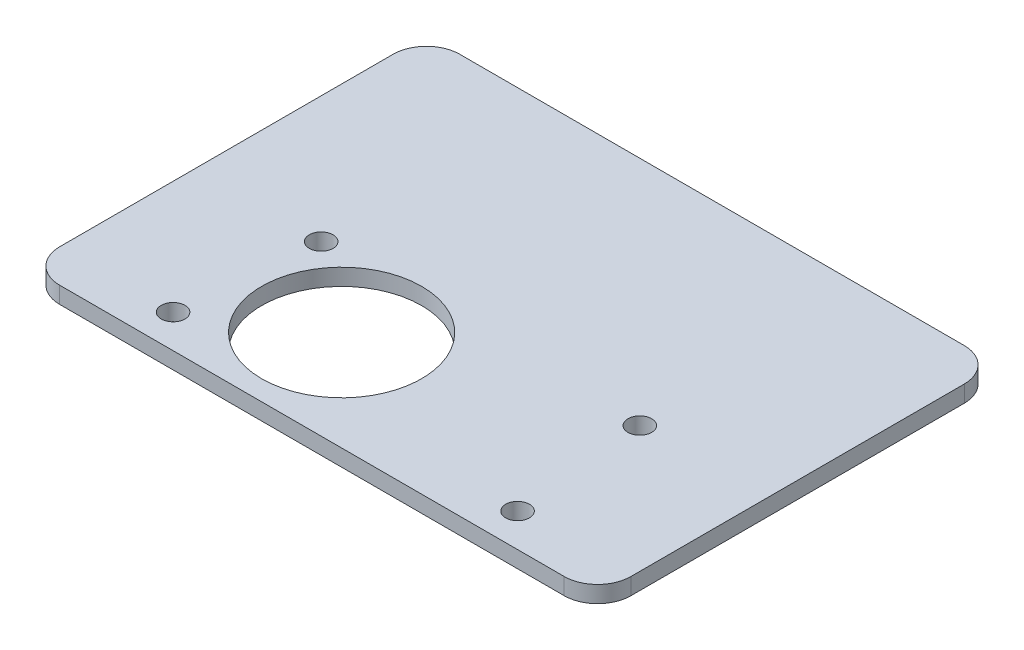
ISO-10303-21;
HEADER;
FILE_DESCRIPTION(('STEP AP214'),'2;1');
FILE_NAME('part.step','',(''),(''),'','','');
FILE_SCHEMA(('AUTOMOTIVE_DESIGN { 1 0 10303 214 1 1 1 1 }'));
ENDSEC;
DATA;
#1=APPLICATION_CONTEXT('core data for automotive mechanical design processes');
#2=APPLICATION_PROTOCOL_DEFINITION('international standard','automotive_design',2000,#1);
#3=PRODUCT_CONTEXT('',#1,'mechanical');
#4=PRODUCT('Part','Part','',(#3));
#5=PRODUCT_RELATED_PRODUCT_CATEGORY('part','',(#4));
#6=PRODUCT_DEFINITION_FORMATION('','',#4);
#7=PRODUCT_DEFINITION_CONTEXT('part definition',#1,'design');
#8=PRODUCT_DEFINITION('design','',#6,#7);
#9=PRODUCT_DEFINITION_SHAPE('','',#8);
#10=(LENGTH_UNIT() NAMED_UNIT(*) SI_UNIT(.MILLI.,.METRE.));
#11=(NAMED_UNIT(*) PLANE_ANGLE_UNIT() SI_UNIT($,.RADIAN.));
#12=(NAMED_UNIT(*) SI_UNIT($,.STERADIAN.) SOLID_ANGLE_UNIT());
#13=UNCERTAINTY_MEASURE_WITH_UNIT(LENGTH_MEASURE(1.E-05),#10,'distance_accuracy_value','');
#14=(GEOMETRIC_REPRESENTATION_CONTEXT(3) GLOBAL_UNCERTAINTY_ASSIGNED_CONTEXT((#13)) GLOBAL_UNIT_ASSIGNED_CONTEXT((#10,
#11,#12)) REPRESENTATION_CONTEXT('',''));
#15=CARTESIAN_POINT('',(0.,0.,0.));
#16=DIRECTION('',(0.,0.,1.));
#17=DIRECTION('',(1.,0.,0.));
#18=AXIS2_PLACEMENT_3D('',#15,#16,#17);
#19=CARTESIAN_POINT('',(30.725,-3.175,-25.4));
#20=DIRECTION('',(0.,-1.,0.));
#21=DIRECTION('',(0.,0.,-1.));
#22=AXIS2_PLACEMENT_3D('',#19,#20,#21);
#23=CYLINDRICAL_SURFACE('',#22,3.175);
#24=CARTESIAN_POINT('',(30.725,-4.7625,-25.4));
#25=DIRECTION('',(0.,-1.,0.));
#26=DIRECTION('',(0.,0.,-1.));
#27=AXIS2_PLACEMENT_3D('',#24,#25,#26);
#28=CIRCLE('',#27,3.175);
#29=CARTESIAN_POINT('',(30.725,-4.7625,-28.575));
#30=VERTEX_POINT('',#29);
#31=CARTESIAN_POINT('',(33.9,-4.7625,-25.4));
#32=VERTEX_POINT('',#31);
#33=EDGE_CURVE('E134',#30,#32,#28,.T.);
#34=ORIENTED_EDGE('',*,*,#33,.F.);
#35=DIRECTION('',(0.,-1.,0.));
#36=VECTOR('',#35,1.);
#37=CARTESIAN_POINT('',(30.725,-3.175,-28.575));
#38=LINE('',#37,#36);
#39=CARTESIAN_POINT('',(30.725,-3.175,-28.575));
#40=VERTEX_POINT('',#39);
#41=EDGE_CURVE('E11',#40,#30,#38,.T.);
#42=ORIENTED_EDGE('',*,*,#41,.F.);
#43=CARTESIAN_POINT('',(30.725,-3.175,-25.4));
#44=DIRECTION('',(0.,-1.,0.));
#45=DIRECTION('',(0.,0.,-1.));
#46=AXIS2_PLACEMENT_3D('',#43,#44,#45);
#47=CIRCLE('',#46,3.175);
#48=CARTESIAN_POINT('',(33.9,-3.175,-25.4));
#49=VERTEX_POINT('',#48);
#50=EDGE_CURVE('E155',#40,#49,#47,.T.);
#51=ORIENTED_EDGE('',*,*,#50,.T.);
#52=DIRECTION('',(0.,-1.,0.));
#53=VECTOR('',#52,1.);
#54=CARTESIAN_POINT('',(33.9,-3.175,-25.4));
#55=LINE('',#54,#53);
#56=EDGE_CURVE('E40',#49,#32,#55,.T.);
#57=ORIENTED_EDGE('',*,*,#56,.T.);
#58=EDGE_LOOP('',(#34,#42,#51,#57));
#59=FACE_BOUND('',#58,.T.);
#60=ADVANCED_FACE('F37',(#59),#23,.T.);
#61=CARTESIAN_POINT('',(-17.325,-3.175,-28.575));
#62=DIRECTION('',(0.,0.,-1.));
#63=DIRECTION('',(-1.,0.,0.));
#64=AXIS2_PLACEMENT_3D('',#61,#62,#63);
#65=PLANE('',#64);
#66=DIRECTION('',(1.,0.,0.));
#67=VECTOR('',#66,1.);
#68=CARTESIAN_POINT('',(-17.325,-4.7625,-28.575));
#69=LINE('',#68,#67);
#70=CARTESIAN_POINT('',(-17.325,-4.7625,-28.575));
#71=VERTEX_POINT('',#70);
#72=EDGE_CURVE('E153',#71,#30,#69,.T.);
#73=ORIENTED_EDGE('',*,*,#72,.F.);
#74=DIRECTION('',(0.,-1.,0.));
#75=VECTOR('',#74,1.);
#76=CARTESIAN_POINT('',(-17.325,-3.175,-28.575));
#77=LINE('',#76,#75);
#78=CARTESIAN_POINT('',(-17.325,-3.175,-28.575));
#79=VERTEX_POINT('',#78);
#80=EDGE_CURVE('E46',#79,#71,#77,.T.);
#81=ORIENTED_EDGE('',*,*,#80,.F.);
#82=DIRECTION('',(1.,0.,0.));
#83=VECTOR('',#82,1.);
#84=CARTESIAN_POINT('',(-17.325,-3.175,-28.575));
#85=LINE('',#84,#83);
#86=EDGE_CURVE('E124',#79,#40,#85,.T.);
#87=ORIENTED_EDGE('',*,*,#86,.T.);
#88=ORIENTED_EDGE('',*,*,#41,.T.);
#89=EDGE_LOOP('',(#73,#81,#87,#88));
#90=FACE_BOUND('',#89,.T.);
#91=ADVANCED_FACE('F167',(#90),#65,.T.);
#92=CARTESIAN_POINT('',(-17.325,-3.175,-25.4));
#93=DIRECTION('',(0.,-1.,0.));
#94=DIRECTION('',(0.,0.,-1.));
#95=AXIS2_PLACEMENT_3D('',#92,#93,#94);
#96=CYLINDRICAL_SURFACE('',#95,3.175);
#97=CARTESIAN_POINT('',(-17.325,-4.7625,-25.4));
#98=DIRECTION('',(0.,-1.,0.));
#99=DIRECTION('',(0.,0.,-1.));
#100=AXIS2_PLACEMENT_3D('',#97,#98,#99);
#101=CIRCLE('',#100,3.175);
#102=CARTESIAN_POINT('',(-20.5,-4.7625,-25.4));
#103=VERTEX_POINT('',#102);
#104=EDGE_CURVE('E111',#103,#71,#101,.T.);
#105=ORIENTED_EDGE('',*,*,#104,.F.);
#106=DIRECTION('',(0.,-1.,0.));
#107=VECTOR('',#106,1.);
#108=CARTESIAN_POINT('',(-20.5,-3.175,-25.4));
#109=LINE('',#108,#107);
#110=CARTESIAN_POINT('',(-20.5,-3.175,-25.4));
#111=VERTEX_POINT('',#110);
#112=EDGE_CURVE('E106',#111,#103,#109,.T.);
#113=ORIENTED_EDGE('',*,*,#112,.F.);
#114=CARTESIAN_POINT('',(-17.325,-3.175,-25.4));
#115=DIRECTION('',(0.,-1.,0.));
#116=DIRECTION('',(0.,0.,-1.));
#117=AXIS2_PLACEMENT_3D('',#114,#115,#116);
#118=CIRCLE('',#117,3.175);
#119=EDGE_CURVE('E109',#111,#79,#118,.T.);
#120=ORIENTED_EDGE('',*,*,#119,.T.);
#121=ORIENTED_EDGE('',*,*,#80,.T.);
#122=EDGE_LOOP('',(#105,#113,#120,#121));
#123=FACE_BOUND('',#122,.T.);
#124=ADVANCED_FACE('F108',(#123),#96,.T.);
#125=CARTESIAN_POINT('',(-20.5,-3.175,6.35));
#126=DIRECTION('',(-1.,0.,0.));
#127=DIRECTION('',(0.,0.,1.));
#128=AXIS2_PLACEMENT_3D('',#125,#126,#127);
#129=PLANE('',#128);
#130=DIRECTION('',(0.,0.,-1.));
#131=VECTOR('',#130,1.);
#132=CARTESIAN_POINT('',(-20.5,-4.7625,6.35));
#133=LINE('',#132,#131);
#134=CARTESIAN_POINT('',(-20.5,-4.7625,6.35));
#135=VERTEX_POINT('',#134);
#136=EDGE_CURVE('E150',#135,#103,#133,.T.);
#137=ORIENTED_EDGE('',*,*,#136,.F.);
#138=DIRECTION('',(0.,-1.,0.));
#139=VECTOR('',#138,1.);
#140=CARTESIAN_POINT('',(-20.5,-3.175,6.35));
#141=LINE('',#140,#139);
#142=CARTESIAN_POINT('',(-20.5,-3.175,6.35));
#143=VERTEX_POINT('',#142);
#144=EDGE_CURVE('E116',#143,#135,#141,.T.);
#145=ORIENTED_EDGE('',*,*,#144,.F.);
#146=DIRECTION('',(0.,0.,-1.));
#147=VECTOR('',#146,1.);
#148=CARTESIAN_POINT('',(-20.5,-3.175,6.35));
#149=LINE('',#148,#147);
#150=EDGE_CURVE('E122',#143,#111,#149,.T.);
#151=ORIENTED_EDGE('',*,*,#150,.T.);
#152=ORIENTED_EDGE('',*,*,#112,.T.);
#153=EDGE_LOOP('',(#137,#145,#151,#152));
#154=FACE_BOUND('',#153,.T.);
#155=ADVANCED_FACE('F126',(#154),#129,.T.);
#156=CARTESIAN_POINT('',(-17.325,-3.175,6.35));
#157=DIRECTION('',(0.,-1.,0.));
#158=DIRECTION('',(0.,0.,-1.));
#159=AXIS2_PLACEMENT_3D('',#156,#157,#158);
#160=CYLINDRICAL_SURFACE('',#159,3.175);
#161=CARTESIAN_POINT('',(-17.325,-4.7625,6.35));
#162=DIRECTION('',(0.,-1.,0.));
#163=DIRECTION('',(0.,0.,-1.));
#164=AXIS2_PLACEMENT_3D('',#161,#162,#163);
#165=CIRCLE('',#164,3.175);
#166=CARTESIAN_POINT('',(-17.325,-4.7625,9.525));
#167=VERTEX_POINT('',#166);
#168=EDGE_CURVE('E147',#167,#135,#165,.T.);
#169=ORIENTED_EDGE('',*,*,#168,.F.);
#170=DIRECTION('',(0.,-1.,0.));
#171=VECTOR('',#170,1.);
#172=CARTESIAN_POINT('',(-17.325,-3.175,9.525));
#173=LINE('',#172,#171);
#174=CARTESIAN_POINT('',(-17.325,-3.175,9.525));
#175=VERTEX_POINT('',#174);
#176=EDGE_CURVE('E159',#175,#167,#173,.T.);
#177=ORIENTED_EDGE('',*,*,#176,.F.);
#178=CARTESIAN_POINT('',(-17.325,-3.175,6.35));
#179=DIRECTION('',(0.,-1.,0.));
#180=DIRECTION('',(0.,0.,-1.));
#181=AXIS2_PLACEMENT_3D('',#178,#179,#180);
#182=CIRCLE('',#181,3.175);
#183=EDGE_CURVE('E127',#175,#143,#182,.T.);
#184=ORIENTED_EDGE('',*,*,#183,.T.);
#185=ORIENTED_EDGE('',*,*,#144,.T.);
#186=EDGE_LOOP('',(#169,#177,#184,#185));
#187=FACE_BOUND('',#186,.T.);
#188=ADVANCED_FACE('F180',(#187),#160,.T.);
#189=CARTESIAN_POINT('',(30.725,-3.175,9.525));
#190=DIRECTION('',(0.,0.,1.));
#191=DIRECTION('',(1.,0.,0.));
#192=AXIS2_PLACEMENT_3D('',#189,#190,#191);
#193=PLANE('',#192);
#194=DIRECTION('',(-1.,0.,0.));
#195=VECTOR('',#194,1.);
#196=CARTESIAN_POINT('',(30.725,-4.7625,9.525));
#197=LINE('',#196,#195);
#198=CARTESIAN_POINT('',(30.725,-4.7625,9.525));
#199=VERTEX_POINT('',#198);
#200=EDGE_CURVE('E144',#199,#167,#197,.T.);
#201=ORIENTED_EDGE('',*,*,#200,.F.);
#202=DIRECTION('',(0.,-1.,0.));
#203=VECTOR('',#202,1.);
#204=CARTESIAN_POINT('',(30.725,-3.175,9.525));
#205=LINE('',#204,#203);
#206=CARTESIAN_POINT('',(30.725,-3.175,9.525));
#207=VERTEX_POINT('',#206);
#208=EDGE_CURVE('E161',#207,#199,#205,.T.);
#209=ORIENTED_EDGE('',*,*,#208,.F.);
#210=DIRECTION('',(-1.,0.,0.));
#211=VECTOR('',#210,1.);
#212=CARTESIAN_POINT('',(30.725,-3.175,9.525));
#213=LINE('',#212,#211);
#214=EDGE_CURVE('E129',#207,#175,#213,.T.);
#215=ORIENTED_EDGE('',*,*,#214,.T.);
#216=ORIENTED_EDGE('',*,*,#176,.T.);
#217=EDGE_LOOP('',(#201,#209,#215,#216));
#218=FACE_BOUND('',#217,.T.);
#219=ADVANCED_FACE('F183',(#218),#193,.T.);
#220=CARTESIAN_POINT('',(30.725,-3.175,6.35));
#221=DIRECTION('',(0.,-1.,0.));
#222=DIRECTION('',(0.,0.,-1.));
#223=AXIS2_PLACEMENT_3D('',#220,#221,#222);
#224=CYLINDRICAL_SURFACE('',#223,3.175);
#225=CARTESIAN_POINT('',(30.725,-4.7625,6.35));
#226=DIRECTION('',(0.,-1.,0.));
#227=DIRECTION('',(0.,0.,-1.));
#228=AXIS2_PLACEMENT_3D('',#225,#226,#227);
#229=CIRCLE('',#228,3.175);
#230=CARTESIAN_POINT('',(33.9,-4.7625,6.35));
#231=VERTEX_POINT('',#230);
#232=EDGE_CURVE('E141',#231,#199,#229,.T.);
#233=ORIENTED_EDGE('',*,*,#232,.F.);
#234=DIRECTION('',(0.,-1.,0.));
#235=VECTOR('',#234,1.);
#236=CARTESIAN_POINT('',(33.9,-3.175,6.35));
#237=LINE('',#236,#235);
#238=CARTESIAN_POINT('',(33.9,-3.175,6.35));
#239=VERTEX_POINT('',#238);
#240=EDGE_CURVE('E162',#239,#231,#237,.T.);
#241=ORIENTED_EDGE('',*,*,#240,.F.);
#242=CARTESIAN_POINT('',(30.725,-3.175,6.35));
#243=DIRECTION('',(0.,-1.,0.));
#244=DIRECTION('',(0.,0.,-1.));
#245=AXIS2_PLACEMENT_3D('',#242,#243,#244);
#246=CIRCLE('',#245,3.175);
#247=EDGE_CURVE('E259',#239,#207,#246,.T.);
#248=ORIENTED_EDGE('',*,*,#247,.T.);
#249=ORIENTED_EDGE('',*,*,#208,.T.);
#250=EDGE_LOOP('',(#233,#241,#248,#249));
#251=FACE_BOUND('',#250,.T.);
#252=ADVANCED_FACE('F187',(#251),#224,.T.);
#253=CARTESIAN_POINT('',(33.9,-3.175,-25.4));
#254=DIRECTION('',(1.,0.,0.));
#255=DIRECTION('',(0.,0.,-1.));
#256=AXIS2_PLACEMENT_3D('',#253,#254,#255);
#257=PLANE('',#256);
#258=DIRECTION('',(0.,0.,1.));
#259=VECTOR('',#258,1.);
#260=CARTESIAN_POINT('',(33.9,-4.7625,-25.4));
#261=LINE('',#260,#259);
#262=EDGE_CURVE('E137',#32,#231,#261,.T.);
#263=ORIENTED_EDGE('',*,*,#262,.F.);
#264=ORIENTED_EDGE('',*,*,#56,.F.);
#265=DIRECTION('',(0.,0.,1.));
#266=VECTOR('',#265,1.);
#267=CARTESIAN_POINT('',(33.9,-3.175,-25.4));
#268=LINE('',#267,#266);
#269=EDGE_CURVE('E257',#49,#239,#268,.T.);
#270=ORIENTED_EDGE('',*,*,#269,.T.);
#271=ORIENTED_EDGE('',*,*,#240,.T.);
#272=EDGE_LOOP('',(#263,#264,#270,#271));
#273=FACE_BOUND('',#272,.T.);
#274=ADVANCED_FACE('F164',(#273),#257,.T.);
#275=CARTESIAN_POINT('',(30.725,-3.175,-25.4));
#276=DIRECTION('',(0.,-1.,0.));
#277=DIRECTION('',(0.,0.,-1.));
#278=AXIS2_PLACEMENT_3D('',#275,#276,#277);
#279=PLANE('',#278);
#280=CARTESIAN_POINT('',(-8.475,-3.175,-6.525));
#281=DIRECTION('',(0.,-1.,0.));
#282=DIRECTION('',(0.,0.,1.));
#283=AXIS2_PLACEMENT_3D('',#280,#281,#282);
#284=CIRCLE('',#283,1.1303);
#285=CARTESIAN_POINT('',(-8.475,-3.175,-5.3947));
#286=VERTEX_POINT('',#285);
#287=EDGE_CURVE('E226',#286,#286,#284,.T.);
#288=ORIENTED_EDGE('',*,*,#287,.T.);
#289=EDGE_LOOP('',(#288));
#290=FACE_BOUND('',#289,.T.);
#291=CARTESIAN_POINT('',(21.875,-3.175,-6.525));
#292=DIRECTION('',(0.,-1.,0.));
#293=DIRECTION('',(0.,0.,1.));
#294=AXIS2_PLACEMENT_3D('',#291,#292,#293);
#295=CIRCLE('',#294,1.1303);
#296=CARTESIAN_POINT('',(21.875,-3.175,-5.3947));
#297=VERTEX_POINT('',#296);
#298=EDGE_CURVE('E234',#297,#297,#295,.T.);
#299=ORIENTED_EDGE('',*,*,#298,.T.);
#300=EDGE_LOOP('',(#299));
#301=FACE_BOUND('',#300,.T.);
#302=CARTESIAN_POINT('',(23.105,-3.175,6.35));
#303=DIRECTION('',(0.,-1.,0.));
#304=DIRECTION('',(0.,0.,1.));
#305=AXIS2_PLACEMENT_3D('',#302,#303,#304);
#306=CIRCLE('',#305,1.1303);
#307=CARTESIAN_POINT('',(23.105,-3.175,7.4803));
#308=VERTEX_POINT('',#307);
#309=EDGE_CURVE('E240',#308,#308,#306,.T.);
#310=ORIENTED_EDGE('',*,*,#309,.T.);
#311=EDGE_LOOP('',(#310));
#312=FACE_BOUND('',#311,.T.);
#313=CARTESIAN_POINT('',(-9.705,-3.175,6.35));
#314=DIRECTION('',(0.,-1.,0.));
#315=DIRECTION('',(0.,0.,1.));
#316=AXIS2_PLACEMENT_3D('',#313,#314,#315);
#317=CIRCLE('',#316,1.1303);
#318=CARTESIAN_POINT('',(-9.705,-3.175,7.4803));
#319=VERTEX_POINT('',#318);
#320=EDGE_CURVE('E246',#319,#319,#317,.T.);
#321=ORIENTED_EDGE('',*,*,#320,.T.);
#322=EDGE_LOOP('',(#321));
#323=FACE_BOUND('',#322,.T.);
#324=CARTESIAN_POINT('',(0.,-3.175,0.));
#325=DIRECTION('',(0.,-1.,0.));
#326=DIRECTION('',(0.,0.,1.));
#327=AXIS2_PLACEMENT_3D('',#324,#325,#326);
#328=CIRCLE('',#327,7.62);
#329=CARTESIAN_POINT('',(0.,-3.175,7.62));
#330=VERTEX_POINT('',#329);
#331=EDGE_CURVE('E138',#330,#330,#328,.T.);
#332=ORIENTED_EDGE('',*,*,#331,.T.);
#333=EDGE_LOOP('',(#332));
#334=FACE_BOUND('',#333,.T.);
#335=ORIENTED_EDGE('',*,*,#50,.F.);
#336=ORIENTED_EDGE('',*,*,#86,.F.);
#337=ORIENTED_EDGE('',*,*,#119,.F.);
#338=ORIENTED_EDGE('',*,*,#150,.F.);
#339=ORIENTED_EDGE('',*,*,#183,.F.);
#340=ORIENTED_EDGE('',*,*,#214,.F.);
#341=ORIENTED_EDGE('',*,*,#247,.F.);
#342=ORIENTED_EDGE('',*,*,#269,.F.);
#343=EDGE_LOOP('',(#335,#336,#337,#338,#339,#340,#341,#342));
#344=FACE_BOUND('',#343,.T.);
#345=ADVANCED_FACE('F120',(#290,#301,#312,#323,#334,#344),#279,.F.);
#346=CARTESIAN_POINT('',(30.725,-4.7625,-25.4));
#347=DIRECTION('',(0.,-1.,0.));
#348=DIRECTION('',(0.,0.,-1.));
#349=AXIS2_PLACEMENT_3D('',#346,#347,#348);
#350=PLANE('',#349);
#351=CARTESIAN_POINT('',(-8.475,-4.7625,-6.525));
#352=DIRECTION('',(0.,-1.,0.));
#353=DIRECTION('',(0.,0.,1.));
#354=AXIS2_PLACEMENT_3D('',#351,#352,#353);
#355=CIRCLE('',#354,1.1303);
#356=CARTESIAN_POINT('',(-8.475,-4.7625,-5.3947));
#357=VERTEX_POINT('',#356);
#358=EDGE_CURVE('E229',#357,#357,#355,.T.);
#359=ORIENTED_EDGE('',*,*,#358,.F.);
#360=EDGE_LOOP('',(#359));
#361=FACE_BOUND('',#360,.T.);
#362=CARTESIAN_POINT('',(21.875,-4.7625,-6.525));
#363=DIRECTION('',(0.,-1.,0.));
#364=DIRECTION('',(0.,0.,1.));
#365=AXIS2_PLACEMENT_3D('',#362,#363,#364);
#366=CIRCLE('',#365,1.1303);
#367=CARTESIAN_POINT('',(21.875,-4.7625,-5.3947));
#368=VERTEX_POINT('',#367);
#369=EDGE_CURVE('E231',#368,#368,#366,.T.);
#370=ORIENTED_EDGE('',*,*,#369,.F.);
#371=EDGE_LOOP('',(#370));
#372=FACE_BOUND('',#371,.T.);
#373=CARTESIAN_POINT('',(23.105,-4.7625,6.35));
#374=DIRECTION('',(0.,-1.,0.));
#375=DIRECTION('',(0.,0.,1.));
#376=AXIS2_PLACEMENT_3D('',#373,#374,#375);
#377=CIRCLE('',#376,1.1303);
#378=CARTESIAN_POINT('',(23.105,-4.7625,7.4803));
#379=VERTEX_POINT('',#378);
#380=EDGE_CURVE('E237',#379,#379,#377,.T.);
#381=ORIENTED_EDGE('',*,*,#380,.F.);
#382=EDGE_LOOP('',(#381));
#383=FACE_BOUND('',#382,.T.);
#384=CARTESIAN_POINT('',(-9.705,-4.7625,6.35));
#385=DIRECTION('',(0.,-1.,0.));
#386=DIRECTION('',(0.,0.,1.));
#387=AXIS2_PLACEMENT_3D('',#384,#385,#386);
#388=CIRCLE('',#387,1.1303);
#389=CARTESIAN_POINT('',(-9.705,-4.7625,7.4803));
#390=VERTEX_POINT('',#389);
#391=EDGE_CURVE('E243',#390,#390,#388,.T.);
#392=ORIENTED_EDGE('',*,*,#391,.F.);
#393=EDGE_LOOP('',(#392));
#394=FACE_BOUND('',#393,.T.);
#395=CARTESIAN_POINT('',(0.,-4.7625,0.));
#396=DIRECTION('',(0.,-1.,0.));
#397=DIRECTION('',(0.,0.,1.));
#398=AXIS2_PLACEMENT_3D('',#395,#396,#397);
#399=CIRCLE('',#398,7.62);
#400=CARTESIAN_POINT('',(0.,-4.7625,7.62));
#401=VERTEX_POINT('',#400);
#402=EDGE_CURVE('E249',#401,#401,#399,.T.);
#403=ORIENTED_EDGE('',*,*,#402,.F.);
#404=EDGE_LOOP('',(#403));
#405=FACE_BOUND('',#404,.T.);
#406=ORIENTED_EDGE('',*,*,#33,.T.);
#407=ORIENTED_EDGE('',*,*,#262,.T.);
#408=ORIENTED_EDGE('',*,*,#232,.T.);
#409=ORIENTED_EDGE('',*,*,#200,.T.);
#410=ORIENTED_EDGE('',*,*,#168,.T.);
#411=ORIENTED_EDGE('',*,*,#136,.T.);
#412=ORIENTED_EDGE('',*,*,#104,.T.);
#413=ORIENTED_EDGE('',*,*,#72,.T.);
#414=EDGE_LOOP('',(#406,#407,#408,#409,#410,#411,#412,#413));
#415=FACE_BOUND('',#414,.T.);
#416=ADVANCED_FACE('F166',(#361,#372,#383,#394,#405,#415),#350,.T.);
#417=CARTESIAN_POINT('',(0.,-3.175,0.));
#418=DIRECTION('',(0.,-1.,0.));
#419=DIRECTION('',(0.,0.,-1.));
#420=AXIS2_PLACEMENT_3D('',#417,#418,#419);
#421=CYLINDRICAL_SURFACE('',#420,7.62);
#422=ORIENTED_EDGE('',*,*,#331,.F.);
#423=EDGE_LOOP('',(#422));
#424=FACE_BOUND('',#423,.T.);
#425=ORIENTED_EDGE('',*,*,#402,.T.);
#426=EDGE_LOOP('',(#425));
#427=FACE_BOUND('',#426,.T.);
#428=ADVANCED_FACE('F199',(#424,#427),#421,.F.);
#429=CARTESIAN_POINT('',(-9.705,-3.175,6.35));
#430=DIRECTION('',(0.,-1.,0.));
#431=DIRECTION('',(0.,0.,-1.));
#432=AXIS2_PLACEMENT_3D('',#429,#430,#431);
#433=CYLINDRICAL_SURFACE('',#432,1.1303);
#434=ORIENTED_EDGE('',*,*,#320,.F.);
#435=EDGE_LOOP('',(#434));
#436=FACE_BOUND('',#435,.T.);
#437=ORIENTED_EDGE('',*,*,#391,.T.);
#438=EDGE_LOOP('',(#437));
#439=FACE_BOUND('',#438,.T.);
#440=ADVANCED_FACE('F206',(#436,#439),#433,.F.);
#441=CARTESIAN_POINT('',(23.105,-3.175,6.35));
#442=DIRECTION('',(0.,-1.,0.));
#443=DIRECTION('',(0.,0.,-1.));
#444=AXIS2_PLACEMENT_3D('',#441,#442,#443);
#445=CYLINDRICAL_SURFACE('',#444,1.1303);
#446=ORIENTED_EDGE('',*,*,#309,.F.);
#447=EDGE_LOOP('',(#446));
#448=FACE_BOUND('',#447,.T.);
#449=ORIENTED_EDGE('',*,*,#380,.T.);
#450=EDGE_LOOP('',(#449));
#451=FACE_BOUND('',#450,.T.);
#452=ADVANCED_FACE('F210',(#448,#451),#445,.F.);
#453=CARTESIAN_POINT('',(21.875,-3.175,-6.525));
#454=DIRECTION('',(0.,-1.,0.));
#455=DIRECTION('',(0.,0.,-1.));
#456=AXIS2_PLACEMENT_3D('',#453,#454,#455);
#457=CYLINDRICAL_SURFACE('',#456,1.1303);
#458=ORIENTED_EDGE('',*,*,#298,.F.);
#459=EDGE_LOOP('',(#458));
#460=FACE_BOUND('',#459,.T.);
#461=ORIENTED_EDGE('',*,*,#369,.T.);
#462=EDGE_LOOP('',(#461));
#463=FACE_BOUND('',#462,.T.);
#464=ADVANCED_FACE('F214',(#460,#463),#457,.F.);
#465=CARTESIAN_POINT('',(-8.475,-3.175,-6.525));
#466=DIRECTION('',(0.,-1.,0.));
#467=DIRECTION('',(0.,0.,-1.));
#468=AXIS2_PLACEMENT_3D('',#465,#466,#467);
#469=CYLINDRICAL_SURFACE('',#468,1.1303);
#470=ORIENTED_EDGE('',*,*,#287,.F.);
#471=EDGE_LOOP('',(#470));
#472=FACE_BOUND('',#471,.T.);
#473=ORIENTED_EDGE('',*,*,#358,.T.);
#474=EDGE_LOOP('',(#473));
#475=FACE_BOUND('',#474,.T.);
#476=ADVANCED_FACE('F218',(#472,#475),#469,.F.);
#477=CLOSED_SHELL('',(#60,#91,#124,#155,#188,#219,#252,#274,#345,#416,#428,#440,#452,#464,#476));
#478=MANIFOLD_SOLID_BREP('B2',#477);
#479=ADVANCED_BREP_SHAPE_REPRESENTATION('',(#18,#478),#14);
#480=SHAPE_DEFINITION_REPRESENTATION(#9,#479);
ENDSEC;
END-ISO-10303-21;
